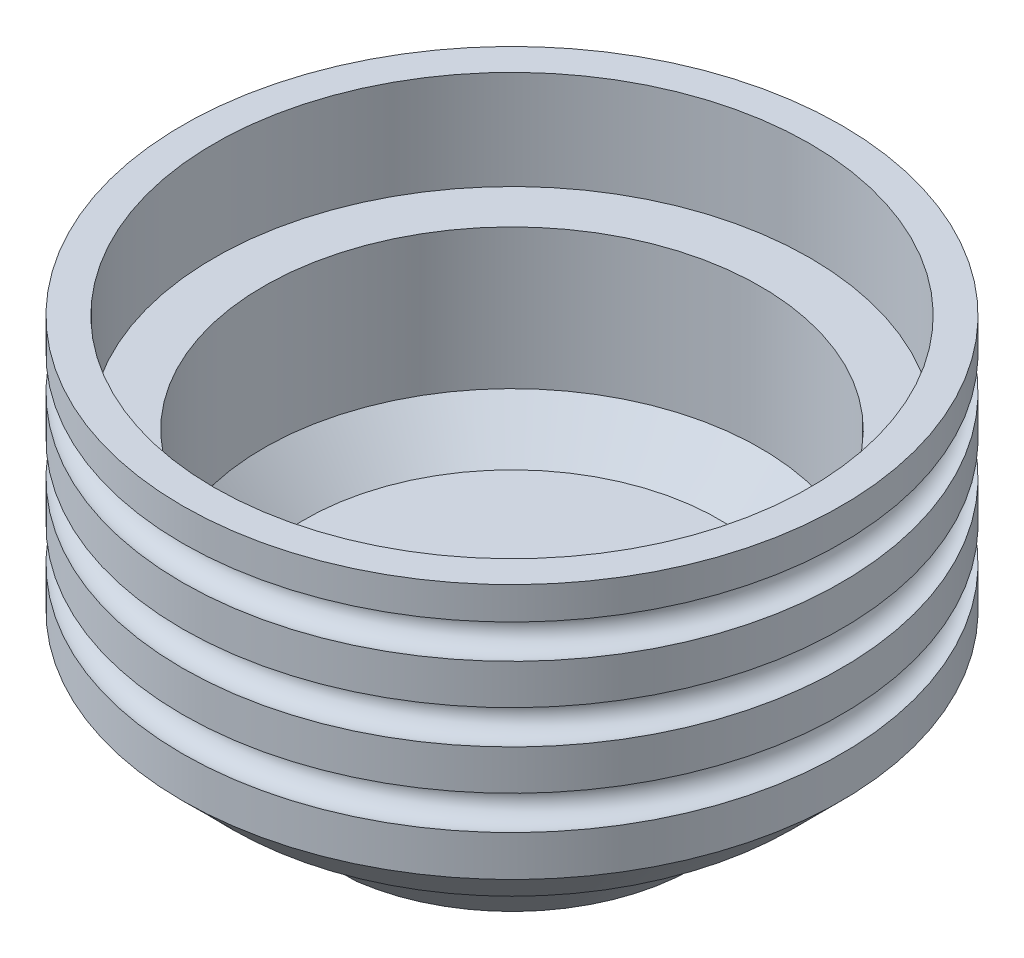
ISO-10303-21;
HEADER;
FILE_DESCRIPTION(('STEP AP214'),'2;1');
FILE_NAME('part.step','',(''),(''),'','','');
FILE_SCHEMA(('AUTOMOTIVE_DESIGN { 1 0 10303 214 1 1 1 1 }'));
ENDSEC;
DATA;
#1=APPLICATION_CONTEXT('core data for automotive mechanical design processes');
#2=APPLICATION_PROTOCOL_DEFINITION('international standard','automotive_design',2000,#1);
#3=PRODUCT_CONTEXT('',#1,'mechanical');
#4=PRODUCT('Part','Part','',(#3));
#5=PRODUCT_RELATED_PRODUCT_CATEGORY('part','',(#4));
#6=PRODUCT_DEFINITION_FORMATION('','',#4);
#7=PRODUCT_DEFINITION_CONTEXT('part definition',#1,'design');
#8=PRODUCT_DEFINITION('design','',#6,#7);
#9=PRODUCT_DEFINITION_SHAPE('','',#8);
#10=(LENGTH_UNIT() NAMED_UNIT(*) SI_UNIT(.MILLI.,.METRE.));
#11=(NAMED_UNIT(*) PLANE_ANGLE_UNIT() SI_UNIT($,.RADIAN.));
#12=(NAMED_UNIT(*) SI_UNIT($,.STERADIAN.) SOLID_ANGLE_UNIT());
#13=UNCERTAINTY_MEASURE_WITH_UNIT(LENGTH_MEASURE(1.E-05),#10,'distance_accuracy_value','');
#14=(GEOMETRIC_REPRESENTATION_CONTEXT(3) GLOBAL_UNCERTAINTY_ASSIGNED_CONTEXT((#13)) GLOBAL_UNIT_ASSIGNED_CONTEXT((#10,
#11,#12)) REPRESENTATION_CONTEXT('',''));
#15=CARTESIAN_POINT('',(0.,0.,0.));
#16=DIRECTION('',(0.,0.,1.));
#17=DIRECTION('',(1.,0.,0.));
#18=AXIS2_PLACEMENT_3D('',#15,#16,#17);
#19=CARTESIAN_POINT('',(0.,-19.,0.));
#20=DIRECTION('',(0.,1.,0.));
#21=DIRECTION('',(0.,0.,1.));
#22=AXIS2_PLACEMENT_3D('',#19,#20,#21);
#23=PLANE('',#22);
#24=CARTESIAN_POINT('',(0.,-19.,-4.));
#25=DIRECTION('',(0.,1.,0.));
#26=DIRECTION('',(0.,0.,1.));
#27=AXIS2_PLACEMENT_3D('',#24,#25,#26);
#28=CIRCLE('',#27,5.125);
#29=CARTESIAN_POINT('',(3.075,-19.,0.0999999999999977));
#30=VERTEX_POINT('',#29);
#31=CARTESIAN_POINT('',(-3.075,-19.,0.0999999999999977));
#32=VERTEX_POINT('',#31);
#33=EDGE_CURVE('E206',#30,#32,#28,.T.);
#34=ORIENTED_EDGE('',*,*,#33,.T.);
#35=DIRECTION('',(1.,0.,0.));
#36=VECTOR('',#35,1.);
#37=CARTESIAN_POINT('',(0.,-19.,0.0999999999999977));
#38=LINE('',#37,#36);
#39=EDGE_CURVE('E166',#32,#30,#38,.T.);
#40=ORIENTED_EDGE('',*,*,#39,.T.);
#41=EDGE_LOOP('',(#34,#40));
#42=FACE_BOUND('',#41,.T.);
#43=DIRECTION('',(0.,0.,-1.));
#44=VECTOR('',#43,1.);
#45=CARTESIAN_POINT('',(-3.,-19.,0.));
#46=LINE('',#45,#44);
#47=CARTESIAN_POINT('',(-3.,-19.,-24.9));
#48=VERTEX_POINT('',#47);
#49=CARTESIAN_POINT('',(-3.,-19.,-25.9206666185133));
#50=VERTEX_POINT('',#49);
#51=EDGE_CURVE('E147',#48,#50,#46,.T.);
#52=ORIENTED_EDGE('',*,*,#51,.F.);
#53=DIRECTION('',(-1.,0.,0.));
#54=VECTOR('',#53,1.);
#55=CARTESIAN_POINT('',(0.,-19.,-24.9));
#56=LINE('',#55,#54);
#57=CARTESIAN_POINT('',(3.,-19.,-24.9));
#58=VERTEX_POINT('',#57);
#59=EDGE_CURVE('E125',#58,#48,#56,.T.);
#60=ORIENTED_EDGE('',*,*,#59,.F.);
#61=DIRECTION('',(0.,0.,1.));
#62=VECTOR('',#61,1.);
#63=CARTESIAN_POINT('',(3.,-19.,0.));
#64=LINE('',#63,#62);
#65=CARTESIAN_POINT('',(3.,-19.,-25.9206666185133));
#66=VERTEX_POINT('',#65);
#67=EDGE_CURVE('E137',#66,#58,#64,.T.);
#68=ORIENTED_EDGE('',*,*,#67,.F.);
#69=CARTESIAN_POINT('',(0.,-19.,-4.));
#70=DIRECTION('',(0.,1.,0.));
#71=DIRECTION('',(0.,0.,1.));
#72=AXIS2_PLACEMENT_3D('',#69,#70,#71);
#73=CIRCLE('',#72,22.1250000000001);
#74=CARTESIAN_POINT('',(3.,-19.,17.9206666185133));
#75=VERTEX_POINT('',#74);
#76=EDGE_CURVE('E224',#66,#75,#73,.F.);
#77=ORIENTED_EDGE('',*,*,#76,.T.);
#78=DIRECTION('',(0.,0.,-1.));
#79=VECTOR('',#78,1.);
#80=CARTESIAN_POINT('',(3.,-19.,0.));
#81=LINE('',#80,#79);
#82=CARTESIAN_POINT('',(3.,-19.,16.1));
#83=VERTEX_POINT('',#82);
#84=EDGE_CURVE('E158',#75,#83,#81,.T.);
#85=ORIENTED_EDGE('',*,*,#84,.T.);
#86=DIRECTION('',(-1.,0.,0.));
#87=VECTOR('',#86,1.);
#88=CARTESIAN_POINT('',(0.,-19.,16.1));
#89=LINE('',#88,#87);
#90=CARTESIAN_POINT('',(-3.,-19.,16.1));
#91=VERTEX_POINT('',#90);
#92=EDGE_CURVE('E344',#83,#91,#89,.T.);
#93=ORIENTED_EDGE('',*,*,#92,.T.);
#94=DIRECTION('',(0.,0.,1.));
#95=VECTOR('',#94,1.);
#96=CARTESIAN_POINT('',(-3.,-19.,0.));
#97=LINE('',#96,#95);
#98=CARTESIAN_POINT('',(-3.,-19.,17.9206666185133));
#99=VERTEX_POINT('',#98);
#100=EDGE_CURVE('E163',#91,#99,#97,.T.);
#101=ORIENTED_EDGE('',*,*,#100,.T.);
#102=EDGE_CURVE('E225',#99,#50,#73,.F.);
#103=ORIENTED_EDGE('',*,*,#102,.T.);
#104=EDGE_LOOP('',(#52,#60,#68,#77,#85,#93,#101,#103));
#105=FACE_BOUND('',#104,.T.);
#106=ADVANCED_FACE('F40',(#42,#105),#23,.F.);
#107=CARTESIAN_POINT('',(0.,-9.00000000000001,-4.));
#108=DIRECTION('',(0.,1.,0.));
#109=DIRECTION('',(0.,0.,1.));
#110=AXIS2_PLACEMENT_3D('',#107,#108,#109);
#111=CONICAL_SURFACE('',#110,32.1250000000002,0.785398163397454);
#112=CARTESIAN_POINT('',(0.,-9.00000000000001,-4.));
#113=DIRECTION('',(0.,-1.,0.));
#114=DIRECTION('',(0.,0.,-1.));
#115=AXIS2_PLACEMENT_3D('',#112,#113,#114);
#116=CIRCLE('',#115,32.1250000000002);
#117=CARTESIAN_POINT('',(0.,-9.,-36.1250000000002));
#118=VERTEX_POINT('',#117);
#119=EDGE_CURVE('E221',#118,#118,#116,.F.);
#120=ORIENTED_EDGE('',*,*,#119,.F.);
#121=EDGE_LOOP('',(#120));
#122=FACE_BOUND('',#121,.T.);
#123=CARTESIAN_POINT('',(-3.,-31.2883984071456,-13.3679630067878));
#124=CARTESIAN_POINT('',(-3.,-30.9571847002128,-13.7156921580461));
#125=CARTESIAN_POINT('',(-3.,-30.6251283592073,-14.0626157323693));
#126=CARTESIAN_POINT('',(-3.,-29.9596807881349,-14.7551770104405));
#127=CARTESIAN_POINT('',(-3.,-29.6262895654317,-15.1008147212616));
#128=CARTESIAN_POINT('',(-3.,-28.9585239138428,-15.7911282513961));
#129=CARTESIAN_POINT('',(-3.,-28.6241494996384,-16.1358040849244));
#130=CARTESIAN_POINT('',(-3.,-27.9546240810409,-16.8244015607096));
#131=CARTESIAN_POINT('',(-3.,-27.6194730754091,-17.1683232017617));
#132=CARTESIAN_POINT('',(-3.,-26.6131233601295,-18.1991865889103));
#133=CARTESIAN_POINT('',(-3.,-25.9410150002997,-18.8852401603259));
#134=CARTESIAN_POINT('',(-3.,-24.5952067675185,-20.2557895234258));
#135=CARTESIAN_POINT('',(-3.,-23.921506886924,-20.9402853075978));
#136=CARTESIAN_POINT('',(-3.,-22.3535043407578,-22.5308475848738));
#137=CARTESIAN_POINT('',(-3.,-21.458784230633,-23.4365024725553));
#138=CARTESIAN_POINT('',(-3.,-19.6680835280415,-25.2465653239826));
#139=CARTESIAN_POINT('',(-3.,-18.7721029350481,-26.150973287207));
#140=CARTESIAN_POINT('',(-3.,-16.979268704656,-27.9589219568187));
#141=CARTESIAN_POINT('',(-3.,-16.0824150679328,-28.862462663876));
#142=CARTESIAN_POINT('',(-3.,-14.2880779452446,-30.6689185052311));
#143=CARTESIAN_POINT('',(-3.,-13.390594459222,-31.5718336394718));
#144=CARTESIAN_POINT('',(-3.,-10.6973824472921,-34.2799620759743));
#145=CARTESIAN_POINT('',(-3.,-8.90096250829623,-36.0844877385659));
#146=CARTESIAN_POINT('',(-3.,-6.20551917333774,-38.7904616327129));
#147=CARTESIAN_POINT('',(-3.,-5.30690348954272,-39.6923161625089));
#148=CARTESIAN_POINT('',(-3.,-3.50944850736083,-41.4958021289376));
#149=CARTESIAN_POINT('',(-3.,-2.61060920900261,-42.3974335655989));
#150=CARTESIAN_POINT('',(-3.,-1.71168208416514,-43.2989774566043));
#151=B_SPLINE_CURVE_WITH_KNOTS('',3,(#123,#124,#125,#126,#127,#128,#129,#130,#131,#132,#133,
#134,#135,#136,#137,#138,#139,#140,#141,#142,#143,#144,#145,#146,#147,#148,#149,#150),
.UNSPECIFIED.,.F.,.F.,(4,2,2,2,2,2,2,2,2,2,2,2,2,4),(0.,1.44067685381629,2.88134577128063,
4.32199328429975,5.7626430968317,8.64388689694456,11.5251445623137,15.3443849663914,
19.1636269669731,22.9828660148264,26.8021054111343,34.4408829177971,38.2602631834437,
42.0796429596989),.UNSPECIFIED.);
#152=CARTESIAN_POINT('',(-3.,-14.0000804913108,-30.9585099431122));
#153=VERTEX_POINT('',#152);
#154=EDGE_CURVE('E134',#50,#153,#151,.T.);
#155=ORIENTED_EDGE('',*,*,#154,.F.);
#156=ORIENTED_EDGE('',*,*,#102,.F.);
#157=CARTESIAN_POINT('',(-3.,-32.0232495696429,4.59312870242873));
#158=CARTESIAN_POINT('',(-3.,-31.7181615775267,4.91621524831907));
#159=CARTESIAN_POINT('',(-3.,-31.4121483833083,5.23842430907756));
#160=CARTESIAN_POINT('',(-3.,-30.7986581689354,5.88144164330902));
#161=CARTESIAN_POINT('',(-3.,-30.4911811600731,6.20224992755151));
#162=CARTESIAN_POINT('',(-3.,-29.8751516790356,6.84281810304724));
#163=CARTESIAN_POINT('',(-3.,-29.5665992296772,7.16257801626696));
#164=CARTESIAN_POINT('',(-3.,-28.9486448141337,7.80127706732667));
#165=CARTESIAN_POINT('',(-3.,-28.639242846054,8.12021620333311));
#166=CARTESIAN_POINT('',(-3.,-27.7100593078777,9.07605091447187));
#167=CARTESIAN_POINT('',(-3.,-27.0892841179938,9.71198037450225));
#168=CARTESIAN_POINT('',(-3.,-25.8459957676491,10.9821447278067));
#169=CARTESIAN_POINT('',(-3.,-25.2234825953044,11.6163796094354));
#170=CARTESIAN_POINT('',(-3.,-23.6210104536009,13.2459458262905));
#171=CARTESIAN_POINT('',(-3.,-22.6401721195672,14.2404122074095));
#172=CARTESIAN_POINT('',(-3.,-20.6767175692679,16.2275885009957));
#173=CARTESIAN_POINT('',(-3.,-19.694101351422,17.2202984119002));
#174=CARTESIAN_POINT('',(-3.,-17.7276969213472,19.2045557825919));
#175=CARTESIAN_POINT('',(-3.,-16.7439087096106,20.1961032428672));
#176=CARTESIAN_POINT('',(-3.,-14.775525614848,22.1783971890029));
#177=CARTESIAN_POINT('',(-3.,-13.7909307317261,23.1691436747682));
#178=CARTESIAN_POINT('',(-3.,-11.821101209923,25.1501196884616));
#179=CARTESIAN_POINT('',(-3.,-10.835866536119,26.140349181461));
#180=CARTESIAN_POINT('',(-3.,-8.8649662052051,28.1203794101149));
#181=CARTESIAN_POINT('',(-3.,-7.87930054803494,29.1101801457093));
#182=CARTESIAN_POINT('',(-3.,-5.90764642236616,31.0894505740272));
#183=CARTESIAN_POINT('',(-3.,-4.92165795543774,32.0789202683151));
#184=CARTESIAN_POINT('',(-3.,-2.9494218420596,34.0576008969679));
#185=CARTESIAN_POINT('',(-3.,-1.9631741956665,35.0468118313893));
#186=CARTESIAN_POINT('',(-3.,-0.976830921667842,36.0359273695811));
#187=B_SPLINE_CURVE_WITH_KNOTS('',3,(#157,#158,#159,#160,#161,#162,#163,#164,#165,#166,#167,
#168,#169,#170,#171,#172,#173,#174,#175,#176,#177,#178,#179,#180,#181,#182,#183,#184,#185,#186),
.UNSPECIFIED.,.F.,.F.,(4,2,2,2,2,2,2,2,2,2,2,2,2,2,4),(0.,1.33310047811417,2.66619068888892,
3.99925278662486,5.33231785974101,7.99837890868154,10.6644582322202,14.8548076208719,
19.0451607357644,23.2355120908177,27.4258639435529,31.6164694856932,35.8070756152406,
39.9976616551168,44.1882467803368),.UNSPECIFIED.);
#188=CARTESIAN_POINT('',(-3.,-14.0000804913108,22.9585099431122));
#189=VERTEX_POINT('',#188);
#190=EDGE_CURVE('E239',#99,#189,#187,.T.);
#191=ORIENTED_EDGE('',*,*,#190,.T.);
#192=CARTESIAN_POINT('',(0.,-14.0000804913108,-4.));
#193=DIRECTION('',(0.,1.,0.));
#194=DIRECTION('',(0.,0.,1.));
#195=AXIS2_PLACEMENT_3D('',#192,#193,#194);
#196=CIRCLE('',#195,27.1249195086894);
#197=CARTESIAN_POINT('',(3.,-14.0000804913108,22.9585099431122));
#198=VERTEX_POINT('',#197);
#199=EDGE_CURVE('E228',#189,#198,#196,.T.);
#200=ORIENTED_EDGE('',*,*,#199,.T.);
#201=CARTESIAN_POINT('',(3.,-0.976830921667844,36.0359273695811));
#202=CARTESIAN_POINT('',(3.,-2.27689023956105,34.732198638874));
#203=CARTESIAN_POINT('',(3.,-3.57679499027358,33.4283156270582));
#204=CARTESIAN_POINT('',(3.,-6.17611074025169,30.82006620614));
#205=CARTESIAN_POINT('',(3.,-7.47552174114422,29.515699798659));
#206=CARTESIAN_POINT('',(3.,-10.0736522377888,26.9063219626293));
#207=CARTESIAN_POINT('',(3.,-11.3723717447703,25.6013105452627));
#208=CARTESIAN_POINT('',(3.,-13.9688324738826,22.9903057710291));
#209=CARTESIAN_POINT('',(3.,-15.2665736926899,21.6843124108559));
#210=CARTESIAN_POINT('',(3.,-17.2120480066494,19.7241552398725));
#211=CARTESIAN_POINT('',(3.,-17.8603593650374,19.070565393936));
#212=CARTESIAN_POINT('',(3.,-19.1564811933819,17.7628898941352));
#213=CARTESIAN_POINT('',(3.,-19.8042916636197,17.10880424055));
#214=CARTESIAN_POINT('',(3.,-21.0992519067023,15.7999901615198));
#215=CARTESIAN_POINT('',(3.,-21.7464016851305,15.1452617415999));
#216=CARTESIAN_POINT('',(3.,-23.0398196886008,13.8349317267779));
#217=CARTESIAN_POINT('',(3.,-23.6860879117997,13.1793301300557));
#218=CARTESIAN_POINT('',(3.,-24.9774121517597,11.866894737262));
#219=CARTESIAN_POINT('',(3.,-25.6224681311512,11.2100609044126));
#220=CARTESIAN_POINT('',(3.,-26.9107970035024,9.89465230618097));
#221=CARTESIAN_POINT('',(3.,-27.5540699066914,9.23607755082869));
#222=CARTESIAN_POINT('',(3.,-28.5169253907263,8.24619670823175));
#223=CARTESIAN_POINT('',(3.,-28.8375399949232,7.91589470114628));
#224=CARTESIAN_POINT('',(3.,-29.4778812949687,7.25443240122578));
#225=CARTESIAN_POINT('',(3.,-29.7976079929087,6.92327211041583));
#226=CARTESIAN_POINT('',(3.,-30.4359296897338,6.2598488347081));
#227=CARTESIAN_POINT('',(3.,-30.7545246662437,5.92758582825694));
#228=CARTESIAN_POINT('',(3.,-31.3901592752795,5.26157084451692));
#229=CARTESIAN_POINT('',(3.,-31.7071988950944,4.92781885510191));
#230=CARTESIAN_POINT('',(3.,-32.0232495696429,4.59312870242875));
#231=B_SPLINE_CURVE_WITH_KNOTS('',3,(#201,#202,#203,#204,#205,#206,#207,#208,#209,#210,#211,
#212,#213,#214,#215,#216,#217,#218,#219,#220,#221,#222,#223,#224,#225,#226,#227,#228,#229,#230),
.UNSPECIFIED.,.F.,.F.,(4,2,2,2,2,2,2,2,2,2,2,2,2,2,4),(0.,5.52347419525201,11.0469300297394,
16.5702932501609,22.09367515142,24.8554471654088,27.6172176265865,30.3789645522743,
33.1407172432266,35.9025537173417,38.6643743141079,40.0453285840018,41.4262795985574,
42.8072577656563,44.1882471999239),.UNSPECIFIED.);
#232=EDGE_CURVE('E231',#198,#75,#231,.T.);
#233=ORIENTED_EDGE('',*,*,#232,.T.);
#234=ORIENTED_EDGE('',*,*,#76,.F.);
#235=CARTESIAN_POINT('',(3.,-1.71168208416514,-43.2989774566043));
#236=CARTESIAN_POINT('',(3.,-2.94964353312506,-42.0573923011552));
#237=CARTESIAN_POINT('',(3.,-4.1874551417678,-40.815657607785));
#238=CARTESIAN_POINT('',(3.,-6.6626111111398,-38.3317284235228));
#239=CARTESIAN_POINT('',(3.,-7.89995547295336,-37.0895339337113));
#240=CARTESIAN_POINT('',(3.,-10.3739985792917,-34.6045352965688));
#241=CARTESIAN_POINT('',(3.,-11.6106973322499,-33.3617311576348));
#242=CARTESIAN_POINT('',(3.,-14.0831880300543,-30.875214909128));
#243=CARTESIAN_POINT('',(3.,-15.318979972692,-29.6315027973585));
#244=CARTESIAN_POINT('',(3.,-17.171632721341,-27.7648793655712));
#245=CARTESIAN_POINT('',(3.,-17.7890180512612,-27.1424886682806));
#246=CARTESIAN_POINT('',(3.,-19.0233404844451,-25.8972633496616));
#247=CARTESIAN_POINT('',(3.,-19.6402775878673,-25.2744287284904));
#248=CARTESIAN_POINT('',(3.,-20.873570096739,-24.02819116622));
#249=CARTESIAN_POINT('',(3.,-21.4899255056648,-23.4047882285615));
#250=CARTESIAN_POINT('',(3.,-22.721871702521,-22.1572254505722));
#251=CARTESIAN_POINT('',(3.,-23.3374624894348,-21.5330656092371));
#252=CARTESIAN_POINT('',(3.,-24.5676128645026,-20.2837031445064));
#253=CARTESIAN_POINT('',(3.,-25.1821724295518,-19.658500498356));
#254=CARTESIAN_POINT('',(3.,-26.4098186286521,-18.4066539546145));
#255=CARTESIAN_POINT('',(3.,-27.0229052680878,-17.7800100623087));
#256=CARTESIAN_POINT('',(3.,-27.9408973403711,-16.8384337452955));
#257=CARTESIAN_POINT('',(3.,-28.2466250530123,-16.5243031137879));
#258=CARTESIAN_POINT('',(3.,-28.8573902765443,-15.8953722535539));
#259=CARTESIAN_POINT('',(3.,-29.162427788368,-15.5805720257338));
#260=CARTESIAN_POINT('',(3.,-29.7716419920526,-14.9501315165157));
#261=CARTESIAN_POINT('',(3.,-30.0758186731944,-14.6344912247514));
#262=CARTESIAN_POINT('',(3.,-30.6830325697609,-14.0021139926191));
#263=CARTESIAN_POINT('',(3.,-30.9860697798543,-13.6853770471334));
#264=CARTESIAN_POINT('',(3.,-31.2883984071456,-13.3679630067878));
#265=B_SPLINE_CURVE_WITH_KNOTS('',3,(#235,#236,#237,#238,#239,#240,#241,#242,#243,#244,#245,
#246,#247,#248,#249,#250,#251,#252,#253,#254,#255,#256,#257,#258,#259,#260,#261,#262,#263,#264),
.UNSPECIFIED.,.F.,.F.,(4,2,2,2,2,2,2,2,2,2,2,2,2,2,4),(0.,5.25991840845978,10.519824534749,
15.7796601407199,21.0395085151574,23.6694918904005,26.2994743347235,28.9294409609834,
31.5594110806291,34.1894393592535,36.8194580084466,38.1344961120592,39.4495324370784,
40.7645850654845,42.0796438389727),.UNSPECIFIED.);
#266=CARTESIAN_POINT('',(3.,-14.0000804913108,-30.9585099431122));
#267=VERTEX_POINT('',#266);
#268=EDGE_CURVE('E337',#267,#66,#265,.T.);
#269=ORIENTED_EDGE('',*,*,#268,.F.);
#270=CARTESIAN_POINT('',(0.,-14.0000804913108,-4.));
#271=DIRECTION('',(0.,-1.,0.));
#272=DIRECTION('',(0.,0.,-1.));
#273=AXIS2_PLACEMENT_3D('',#270,#271,#272);
#274=CIRCLE('',#273,27.1249195086894);
#275=EDGE_CURVE('E343',#153,#267,#274,.T.);
#276=ORIENTED_EDGE('',*,*,#275,.F.);
#277=EDGE_LOOP('',(#155,#156,#191,#200,#233,#234,#269,#276));
#278=FACE_BOUND('',#277,.T.);
#279=ADVANCED_FACE('F247',(#122,#278),#111,.T.);
#280=CARTESIAN_POINT('',(0.,-2.,-4.));
#281=DIRECTION('',(0.,1.,0.));
#282=DIRECTION('',(0.,0.,1.));
#283=AXIS2_PLACEMENT_3D('',#280,#281,#282);
#284=CYLINDRICAL_SURFACE('',#283,40.);
#285=CARTESIAN_POINT('',(0.,6.06533895523229,-4.));
#286=DIRECTION('',(0.,1.,0.));
#287=DIRECTION('',(0.,0.,1.));
#288=AXIS2_PLACEMENT_3D('',#285,#286,#287);
#289=CIRCLE('',#288,40.);
#290=CARTESIAN_POINT('',(0.,6.06533895523229,36.));
#291=VERTEX_POINT('',#290);
#292=EDGE_CURVE('E212',#291,#291,#289,.T.);
#293=ORIENTED_EDGE('',*,*,#292,.T.);
#294=EDGE_LOOP('',(#293));
#295=FACE_BOUND('',#294,.T.);
#296=CARTESIAN_POINT('',(0.,10.9346610447677,-4.));
#297=DIRECTION('',(0.,1.,0.));
#298=DIRECTION('',(0.,0.,1.));
#299=AXIS2_PLACEMENT_3D('',#296,#297,#298);
#300=CIRCLE('',#299,40.);
#301=CARTESIAN_POINT('',(0.,10.9346610447677,36.));
#302=VERTEX_POINT('',#301);
#303=EDGE_CURVE('E177',#302,#302,#300,.T.);
#304=ORIENTED_EDGE('',*,*,#303,.F.);
#305=EDGE_LOOP('',(#304));
#306=FACE_BOUND('',#305,.T.);
#307=ADVANCED_FACE('F283',(#295,#306),#284,.T.);
#308=CARTESIAN_POINT('',(0.,4.,-4.));
#309=DIRECTION('',(0.,1.,0.));
#310=DIRECTION('',(0.,0.,1.));
#311=AXIS2_PLACEMENT_3D('',#308,#309,#310);
#312=TOROIDAL_SURFACE('',#311,39.5,2.125);
#313=CARTESIAN_POINT('',(0.,1.93466104476771,-4.));
#314=DIRECTION('',(0.,1.,0.));
#315=DIRECTION('',(0.,0.,1.));
#316=AXIS2_PLACEMENT_3D('',#313,#314,#315);
#317=CIRCLE('',#316,40.);
#318=CARTESIAN_POINT('',(0.,1.9346610447677,36.));
#319=VERTEX_POINT('',#318);
#320=EDGE_CURVE('E209',#319,#319,#317,.T.);
#321=ORIENTED_EDGE('',*,*,#320,.T.);
#322=EDGE_LOOP('',(#321));
#323=FACE_BOUND('',#322,.T.);
#324=ORIENTED_EDGE('',*,*,#292,.F.);
#325=EDGE_LOOP('',(#324));
#326=FACE_BOUND('',#325,.T.);
#327=ADVANCED_FACE('F409',(#323,#326),#312,.F.);
#328=CARTESIAN_POINT('',(0.,-3.00000000000001,-4.));
#329=DIRECTION('',(0.,-1.,0.));
#330=DIRECTION('',(0.,0.,-1.));
#331=AXIS2_PLACEMENT_3D('',#328,#329,#330);
#332=CIRCLE('',#331,40.);
#333=CARTESIAN_POINT('',(0.,-3.00000000000001,-44.));
#334=VERTEX_POINT('',#333);
#335=EDGE_CURVE('E49',#334,#334,#332,.F.);
#336=ORIENTED_EDGE('',*,*,#335,.T.);
#337=EDGE_LOOP('',(#336));
#338=FACE_BOUND('',#337,.T.);
#339=ORIENTED_EDGE('',*,*,#320,.F.);
#340=EDGE_LOOP('',(#339));
#341=FACE_BOUND('',#340,.T.);
#342=ADVANCED_FACE('F394',(#338,#341),#284,.T.);
#343=CARTESIAN_POINT('',(0.,-9.00000000000001,0.));
#344=DIRECTION('',(0.,-1.,0.));
#345=DIRECTION('',(0.,0.,-1.));
#346=AXIS2_PLACEMENT_3D('',#343,#344,#345);
#347=PLANE('',#346);
#348=CARTESIAN_POINT('',(0.,-9.00000000000001,-4.));
#349=DIRECTION('',(0.,-1.,0.));
#350=DIRECTION('',(0.,0.,-1.));
#351=AXIS2_PLACEMENT_3D('',#348,#349,#350);
#352=CIRCLE('',#351,34.);
#353=CARTESIAN_POINT('',(0.,-9.,-38.));
#354=VERTEX_POINT('',#353);
#355=EDGE_CURVE('E12',#354,#354,#352,.T.);
#356=ORIENTED_EDGE('',*,*,#355,.T.);
#357=EDGE_LOOP('',(#356));
#358=FACE_BOUND('',#357,.T.);
#359=ORIENTED_EDGE('',*,*,#119,.T.);
#360=EDGE_LOOP('',(#359));
#361=FACE_BOUND('',#360,.T.);
#362=ADVANCED_FACE('F312',(#358,#361),#347,.T.);
#363=CARTESIAN_POINT('',(0.,-2.,-4.));
#364=DIRECTION('',(0.,1.,0.));
#365=DIRECTION('',(0.,0.,1.));
#366=AXIS2_PLACEMENT_3D('',#363,#364,#365);
#367=CYLINDRICAL_SURFACE('',#366,5.12499999999999);
#368=CARTESIAN_POINT('',(1.65,-17.0000804913108,-8.85212582277087));
#369=CARTESIAN_POINT('',(1.64999983049932,-16.9100162160121,-8.85212602928842));
#370=CARTESIAN_POINT('',(1.64260084886905,-16.8199496326794,-8.85466088321865));
#371=CARTESIAN_POINT('',(1.6132917939833,-16.6424724729104,-8.86447812677328));
#372=CARTESIAN_POINT('',(1.59137849798871,-16.5550624908516,-8.87176157076268));
#373=CARTESIAN_POINT('',(1.53388039924043,-16.3854962825735,-8.89016738101737));
#374=CARTESIAN_POINT('',(1.4983209401767,-16.303330644526,-8.90128262698166));
#375=CARTESIAN_POINT('',(1.41462539935678,-16.1461067570813,-8.92608953559805));
#376=CARTESIAN_POINT('',(1.36648684239488,-16.071049910455,-8.93978170516629));
#377=CARTESIAN_POINT('',(1.25711888495623,-15.9274363781356,-8.96875985617042));
#378=CARTESIAN_POINT('',(1.19550898211507,-15.8591770073063,-8.98408358709558));
#379=CARTESIAN_POINT('',(1.06176045553053,-15.7337584590155,-9.01427801289509));
#380=CARTESIAN_POINT('',(0.989620268548545,-15.676600932583,-9.02914864010856));
#381=CARTESIAN_POINT('',(0.834705633882425,-15.5736800989301,-9.05719549672786));
#382=CARTESIAN_POINT('',(0.751716411566314,-15.5282253590672,-9.07032212307545));
#383=CARTESIAN_POINT('',(0.578775675174062,-15.4520364844895,-9.09295937533634));
#384=CARTESIAN_POINT('',(0.488825910590631,-15.4212986646307,-9.10247090635311));
#385=CARTESIAN_POINT('',(0.307632385652744,-15.3764157887833,-9.11653899572064));
#386=CARTESIAN_POINT('',(0.216526612611126,-15.3617620518389,-9.12124710362544));
#387=CARTESIAN_POINT('',(0.0330359420991678,-15.3478490476392,-9.12571432575045));
#388=CARTESIAN_POINT('',(-0.0593486419137782,-15.3485860723669,-9.12547463201917));
#389=CARTESIAN_POINT('',(-0.239185254371301,-15.3651043818021,-9.12017752267657));
#390=CARTESIAN_POINT('',(-0.326694023397648,-15.380333760455,-9.11529685247835));
#391=CARTESIAN_POINT('',(-0.497840163647901,-15.4244957253302,-9.10148558505181));
#392=CARTESIAN_POINT('',(-0.581477277140357,-15.4534292223833,-9.09255471863285));
#393=CARTESIAN_POINT('',(-0.743749501835258,-15.5245181212971,-9.0714147425167));
#394=CARTESIAN_POINT('',(-0.822307857654039,-15.5668363190727,-9.05916555092322));
#395=CARTESIAN_POINT('',(-0.971376205816892,-15.6633612192278,-9.03267261096371));
#396=CARTESIAN_POINT('',(-1.04188406211286,-15.7175710657377,-9.01842833546186));
#397=CARTESIAN_POINT('',(-1.17613772548699,-15.8391508466641,-8.988713542197));
#398=CARTESIAN_POINT('',(-1.23944822328006,-15.9069956992476,-8.97321664950998));
#399=CARTESIAN_POINT('',(-1.35392782485948,-16.0524789593197,-8.94327974163394));
#400=CARTESIAN_POINT('',(-1.40509530956786,-16.1301186706858,-8.92883986755888));
#401=CARTESIAN_POINT('',(-1.49438517364342,-16.2942840245871,-8.90251372670318));
#402=CARTESIAN_POINT('',(-1.53233637776412,-16.3809086665386,-8.89066165995097));
#403=CARTESIAN_POINT('',(-1.59297146774133,-16.5597944939294,-8.87125162047892));
#404=CARTESIAN_POINT('',(-1.6156612420187,-16.6520534904227,-8.86369199175427));
#405=CARTESIAN_POINT('',(-1.6442689239939,-16.835397673135,-8.85409353827029));
#406=CARTESIAN_POINT('',(-1.65085717843499,-16.9263667647321,-8.85183421841321));
#407=CARTESIAN_POINT('',(-1.64896429002488,-17.1081202616428,-8.85247813619806));
#408=CARTESIAN_POINT('',(-1.6404856537904,-17.1989046951617,-8.85538051510942));
#409=CARTESIAN_POINT('',(-1.60930025053497,-17.3747537281604,-8.86580215079394));
#410=CARTESIAN_POINT('',(-1.58704706541697,-17.4599084176804,-8.87317407700031));
#411=CARTESIAN_POINT('',(-1.52948200992128,-17.6252624836598,-8.89154540336148));
#412=CARTESIAN_POINT('',(-1.49416792507597,-17.7054610171132,-8.90254541862234));
#413=CARTESIAN_POINT('',(-1.41027408634907,-17.8612961265691,-8.92734358581304));
#414=CARTESIAN_POINT('',(-1.36132743765666,-17.936723069827,-8.94121591750569));
#415=CARTESIAN_POINT('',(-1.25198056363882,-18.0785362460366,-8.9700464283148));
#416=CARTESIAN_POINT('',(-1.19157718249031,-18.1449199793066,-8.98500490591409));
#417=CARTESIAN_POINT('',(-1.05784428224043,-18.2698048548184,-9.01512565015637));
#418=CARTESIAN_POINT('',(-0.984059988272022,-18.3278252691998,-9.03026748672438));
#419=CARTESIAN_POINT('',(-0.82743309070238,-18.4306853694762,-9.05838915459137));
#420=CARTESIAN_POINT('',(-0.744590865748952,-18.475525606052,-9.07136907620748));
#421=CARTESIAN_POINT('',(-0.572671043251403,-18.5503289423053,-9.09363567347041));
#422=CARTESIAN_POINT('',(-0.483642025141414,-18.5803956632171,-9.10294797942228));
#423=CARTESIAN_POINT('',(-0.301435604710491,-18.6250193061648,-9.11694209462154));
#424=CARTESIAN_POINT('',(-0.208259599627755,-18.6395814115471,-9.12162545133492));
#425=CARTESIAN_POINT('',(-0.0248164420782275,-18.6523408657197,-9.12572504021065));
#426=CARTESIAN_POINT('',(0.0653981180056883,-18.6512306218564,-9.12536413600201));
#427=CARTESIAN_POINT('',(0.24429624382559,-18.634366313943,-9.11995623002809));
#428=CARTESIAN_POINT('',(0.332979919539162,-18.618613306315,-9.11490956632329));
#429=CARTESIAN_POINT('',(0.505073884575932,-18.5733602154026,-9.10077284119828));
#430=CARTESIAN_POINT('',(0.588540535984569,-18.5440552554887,-9.0917402516494));
#431=CARTESIAN_POINT('',(0.74940927644244,-18.4727081704045,-9.07056215986822));
#432=CARTESIAN_POINT('',(0.826810293962294,-18.4306638010991,-9.05841610923633));
#433=CARTESIAN_POINT('',(0.976328228035729,-18.3333171972515,-9.03173744481256));
#434=CARTESIAN_POINT('',(1.04816191081606,-18.2775991057753,-9.01713568395568));
#435=CARTESIAN_POINT('',(1.18168809671543,-18.1552083670374,-8.9873767454206));
#436=CARTESIAN_POINT('',(1.24337746380322,-18.0885323449111,-8.97221939775161));
#437=CARTESIAN_POINT('',(1.35709919774836,-17.9432613500588,-8.94241755328903));
#438=CARTESIAN_POINT('',(1.40870695262712,-17.8643252209891,-8.92781082326864));
#439=CARTESIAN_POINT('',(1.49787626113833,-17.6984534455356,-8.90144520275025));
#440=CARTESIAN_POINT('',(1.53544262173759,-17.6115205495088,-8.88968533813571));
#441=CARTESIAN_POINT('',(1.59323260307512,-17.4381316907427,-8.87114942240703));
#442=CARTESIAN_POINT('',(1.61445467213174,-17.3520386835132,-8.86409082842599));
#443=CARTESIAN_POINT('',(1.64283643353991,-17.1773242035454,-8.85457958876868));
#444=CARTESIAN_POINT('',(1.65000016678815,-17.0887034648051,-8.85212561955824));
#445=CARTESIAN_POINT('',(1.65,-17.0000804913108,-8.85212582277087));
#446=B_SPLINE_CURVE_WITH_KNOTS('',3,(#368,#369,#370,#371,#372,#373,#374,#375,#376,#377,#378,
#379,#380,#381,#382,#383,#384,#385,#386,#387,#388,#389,#390,#391,#392,#393,#394,#395,#396,#397,
#398,#399,#400,#401,#402,#403,#404,#405,#406,#407,#408,#409,#410,#411,#412,#413,#414,#415,#416,
#417,#418,#419,#420,#421,#422,#423,#424,#425,#426,#427,#428,#429,#430,#431,#432,#433,#434,#435,
#436,#437,#438,#439,#440,#441,#442,#443,#444,#445),.UNSPECIFIED.,.T.,.F.,(4,2,2,2,2,2,2,2,2,2,2,
2,2,2,2,2,2,2,2,2,2,2,2,2,2,2,2,2,2,2,2,2,2,2,2,2,2,2,4),(0.,0.269865094985513,
0.539790130554647,0.809216267928944,1.07869546061439,1.35709268763894,1.63553128531617,
1.92069538304685,2.20578803776465,2.48157838991121,2.75730229807596,3.02292925359264,
3.2885738662226,3.5575824741119,3.82666229330204,4.10760808747497,4.3885913202885,
4.67308912889343,4.95747710471673,5.22980683176341,5.50209125667329,5.76585437873718,
6.02966224219495,6.30140108708498,6.57321489300144,6.85709475744246,7.1409627594151,
7.42281023588044,7.70456345833023,7.97390925926538,8.24323562939099,8.50879946546866,
8.77441010967602,9.04940314386414,9.32448103070252,9.60940334022482,9.89422801918216,
10.1598508146574,10.4253972489193),.UNSPECIFIED.);
#447=CARTESIAN_POINT('',(1.65,-17.0000804913108,-8.85212582277087));
#448=VERTEX_POINT('',#447);
#449=EDGE_CURVE('E128',#448,#448,#446,.T.);
#450=ORIENTED_EDGE('',*,*,#449,.F.);
#451=EDGE_LOOP('',(#450));
#452=FACE_BOUND('',#451,.T.);
#453=DIRECTION('',(0.,-1.,0.));
#454=VECTOR('',#453,1.);
#455=CARTESIAN_POINT('',(-3.075,-7.50000000000001,0.0999999999999992));
#456=LINE('',#455,#454);
#457=CARTESIAN_POINT('',(-3.075,-7.50000000000001,0.0999999999999992));
#458=VERTEX_POINT('',#457);
#459=EDGE_CURVE('E172',#458,#32,#456,.T.);
#460=ORIENTED_EDGE('',*,*,#459,.T.);
#461=ORIENTED_EDGE('',*,*,#33,.F.);
#462=DIRECTION('',(0.,-1.,0.));
#463=VECTOR('',#462,1.);
#464=CARTESIAN_POINT('',(3.075,-7.50000000000001,0.0999999999999992));
#465=LINE('',#464,#463);
#466=CARTESIAN_POINT('',(3.075,-7.50000000000001,0.0999999999999992));
#467=VERTEX_POINT('',#466);
#468=EDGE_CURVE('E174',#467,#30,#465,.T.);
#469=ORIENTED_EDGE('',*,*,#468,.F.);
#470=CARTESIAN_POINT('',(0.,-7.50000000000001,-4.));
#471=DIRECTION('',(0.,-1.,0.));
#472=DIRECTION('',(0.,0.,-1.));
#473=AXIS2_PLACEMENT_3D('',#470,#471,#472);
#474=CIRCLE('',#473,5.125);
#475=EDGE_CURVE('E167',#458,#467,#474,.F.);
#476=ORIENTED_EDGE('',*,*,#475,.F.);
#477=EDGE_LOOP('',(#460,#461,#469,#476));
#478=FACE_BOUND('',#477,.T.);
#479=CARTESIAN_POINT('',(0.,-6.,-4.));
#480=DIRECTION('',(0.,1.,0.));
#481=DIRECTION('',(0.,0.,1.));
#482=AXIS2_PLACEMENT_3D('',#479,#480,#481);
#483=CIRCLE('',#482,5.12499999999999);
#484=CARTESIAN_POINT('',(0.,-6.,1.125));
#485=VERTEX_POINT('',#484);
#486=EDGE_CURVE('E203',#485,#485,#483,.T.);
#487=ORIENTED_EDGE('',*,*,#486,.T.);
#488=EDGE_LOOP('',(#487));
#489=FACE_BOUND('',#488,.T.);
#490=ADVANCED_FACE('F307',(#452,#478,#489),#367,.F.);
#491=CARTESIAN_POINT('',(0.,-6.,0.));
#492=DIRECTION('',(0.,1.,0.));
#493=DIRECTION('',(0.,0.,1.));
#494=AXIS2_PLACEMENT_3D('',#491,#492,#493);
#495=PLANE('',#494);
#496=CARTESIAN_POINT('',(0.,-6.,-4.));
#497=DIRECTION('',(0.,1.,0.));
#498=DIRECTION('',(0.,0.,1.));
#499=AXIS2_PLACEMENT_3D('',#496,#497,#498);
#500=CIRCLE('',#499,25.15);
#501=CARTESIAN_POINT('',(0.,-6.00000000000001,21.15));
#502=VERTEX_POINT('',#501);
#503=EDGE_CURVE('E215',#502,#502,#500,.T.);
#504=ORIENTED_EDGE('',*,*,#503,.T.);
#505=EDGE_LOOP('',(#504));
#506=FACE_BOUND('',#505,.T.);
#507=ORIENTED_EDGE('',*,*,#486,.F.);
#508=EDGE_LOOP('',(#507));
#509=FACE_BOUND('',#508,.T.);
#510=ADVANCED_FACE('F303',(#506,#509),#495,.T.);
#511=CARTESIAN_POINT('',(0.,-2.,-4.));
#512=DIRECTION('',(0.,1.,0.));
#513=DIRECTION('',(0.,0.,1.));
#514=AXIS2_PLACEMENT_3D('',#511,#512,#513);
#515=CYLINDRICAL_SURFACE('',#514,30.15);
#516=CARTESIAN_POINT('',(0.,-1.00000000000002,-4.));
#517=DIRECTION('',(0.,1.,0.));
#518=DIRECTION('',(0.,0.,1.));
#519=AXIS2_PLACEMENT_3D('',#516,#517,#518);
#520=CIRCLE('',#519,30.15);
#521=CARTESIAN_POINT('',(0.,-1.00000000000003,26.15));
#522=VERTEX_POINT('',#521);
#523=EDGE_CURVE('E218',#522,#522,#520,.F.);
#524=ORIENTED_EDGE('',*,*,#523,.T.);
#525=EDGE_LOOP('',(#524));
#526=FACE_BOUND('',#525,.T.);
#527=CARTESIAN_POINT('',(0.,16.,-3.99999999999999));
#528=DIRECTION('',(0.,1.,0.));
#529=DIRECTION('',(0.,0.,1.));
#530=AXIS2_PLACEMENT_3D('',#527,#528,#529);
#531=CIRCLE('',#530,30.15);
#532=CARTESIAN_POINT('',(0.,16.,26.15));
#533=VERTEX_POINT('',#532);
#534=EDGE_CURVE('E200',#533,#533,#531,.T.);
#535=ORIENTED_EDGE('',*,*,#534,.T.);
#536=EDGE_LOOP('',(#535));
#537=FACE_BOUND('',#536,.T.);
#538=ADVANCED_FACE('F299',(#526,#537),#515,.F.);
#539=CARTESIAN_POINT('',(0.,16.,0.));
#540=DIRECTION('',(0.,1.,0.));
#541=DIRECTION('',(0.,0.,1.));
#542=AXIS2_PLACEMENT_3D('',#539,#540,#541);
#543=PLANE('',#542);
#544=CARTESIAN_POINT('',(0.,16.,-3.99999999999999));
#545=DIRECTION('',(0.,1.,0.));
#546=DIRECTION('',(0.,0.,1.));
#547=AXIS2_PLACEMENT_3D('',#544,#545,#546);
#548=CIRCLE('',#547,36.15);
#549=CARTESIAN_POINT('',(0.,16.,32.15));
#550=VERTEX_POINT('',#549);
#551=EDGE_CURVE('E197',#550,#550,#548,.T.);
#552=ORIENTED_EDGE('',*,*,#551,.T.);
#553=EDGE_LOOP('',(#552));
#554=FACE_BOUND('',#553,.T.);
#555=ORIENTED_EDGE('',*,*,#534,.F.);
#556=EDGE_LOOP('',(#555));
#557=FACE_BOUND('',#556,.T.);
#558=ADVANCED_FACE('F295',(#554,#557),#543,.T.);
#559=CARTESIAN_POINT('',(0.,-2.,-4.));
#560=DIRECTION('',(0.,1.,0.));
#561=DIRECTION('',(0.,0.,1.));
#562=AXIS2_PLACEMENT_3D('',#559,#560,#561);
#563=CYLINDRICAL_SURFACE('',#562,36.15);
#564=CARTESIAN_POINT('',(0.,28.,-3.99999999999999));
#565=DIRECTION('',(0.,1.,0.));
#566=DIRECTION('',(0.,0.,1.));
#567=AXIS2_PLACEMENT_3D('',#564,#565,#566);
#568=CIRCLE('',#567,36.15);
#569=CARTESIAN_POINT('',(0.,28.,32.15));
#570=VERTEX_POINT('',#569);
#571=EDGE_CURVE('E194',#570,#570,#568,.T.);
#572=ORIENTED_EDGE('',*,*,#571,.T.);
#573=EDGE_LOOP('',(#572));
#574=FACE_BOUND('',#573,.T.);
#575=ORIENTED_EDGE('',*,*,#551,.F.);
#576=EDGE_LOOP('',(#575));
#577=FACE_BOUND('',#576,.T.);
#578=ADVANCED_FACE('F291',(#574,#577),#563,.F.);
#579=CARTESIAN_POINT('',(0.,28.,0.));
#580=DIRECTION('',(0.,1.,0.));
#581=DIRECTION('',(0.,0.,1.));
#582=AXIS2_PLACEMENT_3D('',#579,#580,#581);
#583=PLANE('',#582);
#584=CARTESIAN_POINT('',(0.,28.,-3.99999999999999));
#585=DIRECTION('',(0.,1.,0.));
#586=DIRECTION('',(0.,0.,1.));
#587=AXIS2_PLACEMENT_3D('',#584,#585,#586);
#588=CIRCLE('',#587,40.);
#589=CARTESIAN_POINT('',(0.,28.,36.));
#590=VERTEX_POINT('',#589);
#591=EDGE_CURVE('E191',#590,#590,#588,.T.);
#592=ORIENTED_EDGE('',*,*,#591,.T.);
#593=EDGE_LOOP('',(#592));
#594=FACE_BOUND('',#593,.T.);
#595=ORIENTED_EDGE('',*,*,#571,.F.);
#596=EDGE_LOOP('',(#595));
#597=FACE_BOUND('',#596,.T.);
#598=ADVANCED_FACE('F288',(#594,#597),#583,.T.);
#599=CARTESIAN_POINT('',(0.,24.0653389552323,-3.99999999999999));
#600=DIRECTION('',(0.,1.,0.));
#601=DIRECTION('',(0.,0.,1.));
#602=AXIS2_PLACEMENT_3D('',#599,#600,#601);
#603=CIRCLE('',#602,40.);
#604=CARTESIAN_POINT('',(0.,24.0653389552323,36.));
#605=VERTEX_POINT('',#604);
#606=EDGE_CURVE('E188',#605,#605,#603,.T.);
#607=ORIENTED_EDGE('',*,*,#606,.T.);
#608=EDGE_LOOP('',(#607));
#609=FACE_BOUND('',#608,.T.);
#610=ORIENTED_EDGE('',*,*,#591,.F.);
#611=EDGE_LOOP('',(#610));
#612=FACE_BOUND('',#611,.T.);
#613=ADVANCED_FACE('F284',(#609,#612),#284,.T.);
#614=CARTESIAN_POINT('',(0.,22.,-4.));
#615=DIRECTION('',(0.,1.,0.));
#616=DIRECTION('',(0.,0.,1.));
#617=AXIS2_PLACEMENT_3D('',#614,#615,#616);
#618=TOROIDAL_SURFACE('',#617,39.5,2.125);
#619=ORIENTED_EDGE('',*,*,#606,.F.);
#620=EDGE_LOOP('',(#619));
#621=FACE_BOUND('',#620,.T.);
#622=CARTESIAN_POINT('',(0.,19.9346610447677,-3.99999999999999));
#623=DIRECTION('',(0.,1.,0.));
#624=DIRECTION('',(0.,0.,1.));
#625=AXIS2_PLACEMENT_3D('',#622,#623,#624);
#626=CIRCLE('',#625,40.);
#627=CARTESIAN_POINT('',(0.,19.9346610447677,36.));
#628=VERTEX_POINT('',#627);
#629=EDGE_CURVE('E185',#628,#628,#626,.T.);
#630=ORIENTED_EDGE('',*,*,#629,.T.);
#631=EDGE_LOOP('',(#630));
#632=FACE_BOUND('',#631,.T.);
#633=ADVANCED_FACE('F281',(#621,#632),#618,.F.);
#634=CARTESIAN_POINT('',(0.,15.0653389552323,-3.99999999999999));
#635=DIRECTION('',(0.,1.,0.));
#636=DIRECTION('',(0.,0.,1.));
#637=AXIS2_PLACEMENT_3D('',#634,#635,#636);
#638=CIRCLE('',#637,40.);
#639=CARTESIAN_POINT('',(0.,15.0653389552323,36.));
#640=VERTEX_POINT('',#639);
#641=EDGE_CURVE('E182',#640,#640,#638,.T.);
#642=ORIENTED_EDGE('',*,*,#641,.T.);
#643=EDGE_LOOP('',(#642));
#644=FACE_BOUND('',#643,.T.);
#645=ORIENTED_EDGE('',*,*,#629,.F.);
#646=EDGE_LOOP('',(#645));
#647=FACE_BOUND('',#646,.T.);
#648=ADVANCED_FACE('F277',(#644,#647),#284,.T.);
#649=CARTESIAN_POINT('',(0.,13.,-4.));
#650=DIRECTION('',(0.,1.,0.));
#651=DIRECTION('',(0.,0.,1.));
#652=AXIS2_PLACEMENT_3D('',#649,#650,#651);
#653=TOROIDAL_SURFACE('',#652,39.5,2.125);
#654=ORIENTED_EDGE('',*,*,#641,.F.);
#655=EDGE_LOOP('',(#654));
#656=FACE_BOUND('',#655,.T.);
#657=ORIENTED_EDGE('',*,*,#303,.T.);
#658=EDGE_LOOP('',(#657));
#659=FACE_BOUND('',#658,.T.);
#660=ADVANCED_FACE('F274',(#656,#659),#653,.F.);
#661=CARTESIAN_POINT('',(0.,-6.,-4.));
#662=DIRECTION('',(0.,1.,0.));
#663=DIRECTION('',(0.,0.,1.));
#664=AXIS2_PLACEMENT_3D('',#661,#662,#663);
#665=CONICAL_SURFACE('',#664,25.15,0.785398163397453);
#666=ORIENTED_EDGE('',*,*,#523,.F.);
#667=EDGE_LOOP('',(#666));
#668=FACE_BOUND('',#667,.T.);
#669=ORIENTED_EDGE('',*,*,#503,.F.);
#670=EDGE_LOOP('',(#669));
#671=FACE_BOUND('',#670,.T.);
#672=ADVANCED_FACE('F272',(#668,#671),#665,.F.);
#673=CARTESIAN_POINT('',(0.,-7.50000000000001,0.0999999999999992));
#674=DIRECTION('',(0.,0.,-1.));
#675=DIRECTION('',(0.,1.,0.));
#676=AXIS2_PLACEMENT_3D('',#673,#674,#675);
#677=PLANE('',#676);
#678=CARTESIAN_POINT('',(0.,-17.0000804913108,0.0999999999999959));
#679=DIRECTION('',(0.,0.,-1.));
#680=DIRECTION('',(0.,1.,0.));
#681=AXIS2_PLACEMENT_3D('',#678,#679,#680);
#682=CIRCLE('',#681,1.65);
#683=CARTESIAN_POINT('',(0.,-15.3500804913108,0.0999999999999962));
#684=VERTEX_POINT('',#683);
#685=EDGE_CURVE('E321',#684,#684,#682,.T.);
#686=ORIENTED_EDGE('',*,*,#685,.F.);
#687=EDGE_LOOP('',(#686));
#688=FACE_BOUND('',#687,.T.);
#689=ORIENTED_EDGE('',*,*,#39,.F.);
#690=ORIENTED_EDGE('',*,*,#459,.F.);
#691=DIRECTION('',(1.,0.,0.));
#692=VECTOR('',#691,1.);
#693=CARTESIAN_POINT('',(0.,-7.50000000000001,0.0999999999999992));
#694=LINE('',#693,#692);
#695=EDGE_CURVE('E169',#458,#467,#694,.T.);
#696=ORIENTED_EDGE('',*,*,#695,.T.);
#697=ORIENTED_EDGE('',*,*,#468,.T.);
#698=EDGE_LOOP('',(#689,#690,#696,#697));
#699=FACE_BOUND('',#698,.T.);
#700=ADVANCED_FACE('F268',(#688,#699),#677,.T.);
#701=CARTESIAN_POINT('',(0.,-7.50000000000001,0.));
#702=DIRECTION('',(0.,-1.,0.));
#703=DIRECTION('',(0.,0.,-1.));
#704=AXIS2_PLACEMENT_3D('',#701,#702,#703);
#705=PLANE('',#704);
#706=ORIENTED_EDGE('',*,*,#475,.T.);
#707=ORIENTED_EDGE('',*,*,#695,.F.);
#708=EDGE_LOOP('',(#706,#707));
#709=FACE_BOUND('',#708,.T.);
#710=ADVANCED_FACE('F265',(#709),#705,.F.);
#711=CARTESIAN_POINT('',(0.,0.,16.1));
#712=DIRECTION('',(0.,0.,-1.));
#713=DIRECTION('',(0.,1.,0.));
#714=AXIS2_PLACEMENT_3D('',#711,#712,#713);
#715=PLANE('',#714);
#716=CARTESIAN_POINT('',(0.,-17.0000804913108,16.1));
#717=DIRECTION('',(0.,0.,1.));
#718=DIRECTION('',(1.,0.,0.));
#719=AXIS2_PLACEMENT_3D('',#716,#717,#718);
#720=CIRCLE('',#719,1.65);
#721=CARTESIAN_POINT('',(1.65,-17.0000804913108,16.1));
#722=VERTEX_POINT('',#721);
#723=EDGE_CURVE('E384',#722,#722,#720,.T.);
#724=ORIENTED_EDGE('',*,*,#723,.F.);
#725=EDGE_LOOP('',(#724));
#726=FACE_BOUND('',#725,.T.);
#727=DIRECTION('',(0.,-1.,0.));
#728=VECTOR('',#727,1.);
#729=CARTESIAN_POINT('',(3.,-14.0000804913108,16.1));
#730=LINE('',#729,#728);
#731=CARTESIAN_POINT('',(3.,-14.0000804913108,16.1));
#732=VERTEX_POINT('',#731);
#733=EDGE_CURVE('E153',#732,#83,#730,.T.);
#734=ORIENTED_EDGE('',*,*,#733,.F.);
#735=DIRECTION('',(1.,0.,0.));
#736=VECTOR('',#735,1.);
#737=CARTESIAN_POINT('',(3.,-14.0000804913108,16.1));
#738=LINE('',#737,#736);
#739=CARTESIAN_POINT('',(-3.,-14.0000804913108,16.1));
#740=VERTEX_POINT('',#739);
#741=EDGE_CURVE('E151',#740,#732,#738,.T.);
#742=ORIENTED_EDGE('',*,*,#741,.F.);
#743=DIRECTION('',(0.,1.,0.));
#744=VECTOR('',#743,1.);
#745=CARTESIAN_POINT('',(-3.,-14.0000804913108,16.1));
#746=LINE('',#745,#744);
#747=EDGE_CURVE('E149',#91,#740,#746,.T.);
#748=ORIENTED_EDGE('',*,*,#747,.F.);
#749=ORIENTED_EDGE('',*,*,#92,.F.);
#750=EDGE_LOOP('',(#734,#742,#748,#749));
#751=FACE_BOUND('',#750,.T.);
#752=ADVANCED_FACE('F258',(#726,#751),#715,.F.);
#753=CARTESIAN_POINT('',(-3.,-14.0000804913108,36.));
#754=DIRECTION('',(-1.,0.,0.));
#755=DIRECTION('',(0.,-1.,0.));
#756=AXIS2_PLACEMENT_3D('',#753,#754,#755);
#757=PLANE('',#756);
#758=ORIENTED_EDGE('',*,*,#747,.T.);
#759=DIRECTION('',(0.,0.,-1.));
#760=VECTOR('',#759,1.);
#761=CARTESIAN_POINT('',(-3.,-14.0000804913108,36.));
#762=LINE('',#761,#760);
#763=EDGE_CURVE('E156',#189,#740,#762,.T.);
#764=ORIENTED_EDGE('',*,*,#763,.F.);
#765=ORIENTED_EDGE('',*,*,#190,.F.);
#766=ORIENTED_EDGE('',*,*,#100,.F.);
#767=EDGE_LOOP('',(#758,#764,#765,#766));
#768=FACE_BOUND('',#767,.T.);
#769=ADVANCED_FACE('F256',(#768),#757,.F.);
#770=CARTESIAN_POINT('',(3.,-14.0000804913108,36.));
#771=DIRECTION('',(1.,0.,0.));
#772=DIRECTION('',(0.,1.,0.));
#773=AXIS2_PLACEMENT_3D('',#770,#771,#772);
#774=PLANE('',#773);
#775=ORIENTED_EDGE('',*,*,#232,.F.);
#776=DIRECTION('',(0.,0.,-1.));
#777=VECTOR('',#776,1.);
#778=CARTESIAN_POINT('',(3.,-14.0000804913108,36.));
#779=LINE('',#778,#777);
#780=EDGE_CURVE('E64',#198,#732,#779,.T.);
#781=ORIENTED_EDGE('',*,*,#780,.T.);
#782=ORIENTED_EDGE('',*,*,#733,.T.);
#783=ORIENTED_EDGE('',*,*,#84,.F.);
#784=EDGE_LOOP('',(#775,#781,#782,#783));
#785=FACE_BOUND('',#784,.T.);
#786=ADVANCED_FACE('F250',(#785),#774,.F.);
#787=CARTESIAN_POINT('',(3.,-14.0000804913108,36.));
#788=DIRECTION('',(0.,1.,0.));
#789=DIRECTION('',(0.,0.,1.));
#790=AXIS2_PLACEMENT_3D('',#787,#788,#789);
#791=PLANE('',#790);
#792=ORIENTED_EDGE('',*,*,#763,.T.);
#793=ORIENTED_EDGE('',*,*,#741,.T.);
#794=ORIENTED_EDGE('',*,*,#780,.F.);
#795=ORIENTED_EDGE('',*,*,#199,.F.);
#796=EDGE_LOOP('',(#792,#793,#794,#795));
#797=FACE_BOUND('',#796,.T.);
#798=ADVANCED_FACE('F255',(#797),#791,.F.);
#799=CARTESIAN_POINT('',(0.,0.,-24.9));
#800=DIRECTION('',(0.,0.,-1.));
#801=DIRECTION('',(0.,1.,0.));
#802=AXIS2_PLACEMENT_3D('',#799,#800,#801);
#803=PLANE('',#802);
#804=CARTESIAN_POINT('',(0.,-17.0000804913108,-24.9));
#805=DIRECTION('',(0.,0.,-1.));
#806=DIRECTION('',(0.,1.,0.));
#807=AXIS2_PLACEMENT_3D('',#804,#805,#806);
#808=CIRCLE('',#807,1.65);
#809=CARTESIAN_POINT('',(0.,-15.3500804913108,-24.9));
#810=VERTEX_POINT('',#809);
#811=EDGE_CURVE('E386',#810,#810,#808,.T.);
#812=ORIENTED_EDGE('',*,*,#811,.F.);
#813=EDGE_LOOP('',(#812));
#814=FACE_BOUND('',#813,.T.);
#815=ORIENTED_EDGE('',*,*,#59,.T.);
#816=DIRECTION('',(0.,1.,0.));
#817=VECTOR('',#816,1.);
#818=CARTESIAN_POINT('',(-3.,-14.0000804913108,-24.9));
#819=LINE('',#818,#817);
#820=CARTESIAN_POINT('',(-3.,-14.0000804913108,-24.9));
#821=VERTEX_POINT('',#820);
#822=EDGE_CURVE('E118',#48,#821,#819,.T.);
#823=ORIENTED_EDGE('',*,*,#822,.T.);
#824=DIRECTION('',(1.,0.,0.));
#825=VECTOR('',#824,1.);
#826=CARTESIAN_POINT('',(3.,-14.0000804913108,-24.9));
#827=LINE('',#826,#825);
#828=CARTESIAN_POINT('',(3.,-14.0000804913108,-24.9));
#829=VERTEX_POINT('',#828);
#830=EDGE_CURVE('E123',#821,#829,#827,.T.);
#831=ORIENTED_EDGE('',*,*,#830,.T.);
#832=DIRECTION('',(0.,-1.,0.));
#833=VECTOR('',#832,1.);
#834=CARTESIAN_POINT('',(3.,-14.0000804913108,-24.9));
#835=LINE('',#834,#833);
#836=EDGE_CURVE('E140',#829,#58,#835,.T.);
#837=ORIENTED_EDGE('',*,*,#836,.T.);
#838=EDGE_LOOP('',(#815,#823,#831,#837));
#839=FACE_BOUND('',#838,.T.);
#840=ADVANCED_FACE('F120',(#814,#839),#803,.T.);
#841=CARTESIAN_POINT('',(-3.,-14.0000804913108,-44.));
#842=DIRECTION('',(1.,0.,0.));
#843=DIRECTION('',(0.,1.,0.));
#844=AXIS2_PLACEMENT_3D('',#841,#842,#843);
#845=PLANE('',#844);
#846=ORIENTED_EDGE('',*,*,#51,.T.);
#847=ORIENTED_EDGE('',*,*,#154,.T.);
#848=DIRECTION('',(0.,0.,1.));
#849=VECTOR('',#848,1.);
#850=CARTESIAN_POINT('',(-3.,-14.0000804913108,-44.));
#851=LINE('',#850,#849);
#852=EDGE_CURVE('E131',#153,#821,#851,.T.);
#853=ORIENTED_EDGE('',*,*,#852,.T.);
#854=ORIENTED_EDGE('',*,*,#822,.F.);
#855=EDGE_LOOP('',(#846,#847,#853,#854));
#856=FACE_BOUND('',#855,.T.);
#857=ADVANCED_FACE('F132',(#856),#845,.T.);
#858=CARTESIAN_POINT('',(3.,-14.0000804913108,-44.));
#859=DIRECTION('',(0.,-1.,0.));
#860=DIRECTION('',(0.,0.,-1.));
#861=AXIS2_PLACEMENT_3D('',#858,#859,#860);
#862=PLANE('',#861);
#863=ORIENTED_EDGE('',*,*,#275,.T.);
#864=DIRECTION('',(0.,0.,1.));
#865=VECTOR('',#864,1.);
#866=CARTESIAN_POINT('',(3.,-14.0000804913108,-44.));
#867=LINE('',#866,#865);
#868=EDGE_CURVE('E56',#267,#829,#867,.T.);
#869=ORIENTED_EDGE('',*,*,#868,.T.);
#870=ORIENTED_EDGE('',*,*,#830,.F.);
#871=ORIENTED_EDGE('',*,*,#852,.F.);
#872=EDGE_LOOP('',(#863,#869,#870,#871));
#873=FACE_BOUND('',#872,.T.);
#874=ADVANCED_FACE('F139',(#873),#862,.T.);
#875=CARTESIAN_POINT('',(3.,-14.0000804913108,-44.));
#876=DIRECTION('',(-1.,0.,0.));
#877=DIRECTION('',(0.,-1.,0.));
#878=AXIS2_PLACEMENT_3D('',#875,#876,#877);
#879=PLANE('',#878);
#880=ORIENTED_EDGE('',*,*,#67,.T.);
#881=ORIENTED_EDGE('',*,*,#836,.F.);
#882=ORIENTED_EDGE('',*,*,#868,.F.);
#883=ORIENTED_EDGE('',*,*,#268,.T.);
#884=EDGE_LOOP('',(#880,#881,#882,#883));
#885=FACE_BOUND('',#884,.T.);
#886=ADVANCED_FACE('F332',(#885),#879,.T.);
#887=CARTESIAN_POINT('',(0.,-17.0000804913108,-44.));
#888=DIRECTION('',(0.,0.,1.));
#889=DIRECTION('',(1.,0.,0.));
#890=AXIS2_PLACEMENT_3D('',#887,#888,#889);
#891=CYLINDRICAL_SURFACE('',#890,1.65);
#892=ORIENTED_EDGE('',*,*,#449,.T.);
#893=EDGE_LOOP('',(#892));
#894=FACE_BOUND('',#893,.T.);
#895=ORIENTED_EDGE('',*,*,#811,.T.);
#896=EDGE_LOOP('',(#895));
#897=FACE_BOUND('',#896,.T.);
#898=ADVANCED_FACE('F327',(#894,#897),#891,.F.);
#899=ORIENTED_EDGE('',*,*,#685,.T.);
#900=EDGE_LOOP('',(#899));
#901=FACE_BOUND('',#900,.T.);
#902=ORIENTED_EDGE('',*,*,#723,.T.);
#903=EDGE_LOOP('',(#902));
#904=FACE_BOUND('',#903,.T.);
#905=ADVANCED_FACE('F323',(#901,#904),#891,.F.);
#906=CARTESIAN_POINT('',(0.,-3.00000000000001,-4.));
#907=DIRECTION('',(0.,1.,0.));
#908=DIRECTION('',(0.,0.,1.));
#909=AXIS2_PLACEMENT_3D('',#906,#907,#908);
#910=CONICAL_SURFACE('',#909,40.,0.78539816339745);
#911=ORIENTED_EDGE('',*,*,#355,.F.);
#912=EDGE_LOOP('',(#911));
#913=FACE_BOUND('',#912,.T.);
#914=ORIENTED_EDGE('',*,*,#335,.F.);
#915=EDGE_LOOP('',(#914));
#916=FACE_BOUND('',#915,.T.);
#917=ADVANCED_FACE('F43',(#913,#916),#910,.T.);
#918=CLOSED_SHELL('',(#106,#279,#307,#327,#342,#362,#490,#510,#538,#558,#578,#598,#613,#633,
#648,#660,#672,#700,#710,#752,#769,#786,#798,#840,#857,#874,#886,#898,#905,#917));
#919=MANIFOLD_SOLID_BREP('B2',#918);
#920=ADVANCED_BREP_SHAPE_REPRESENTATION('',(#18,#919),#14);
#921=SHAPE_DEFINITION_REPRESENTATION(#9,#920);
ENDSEC;
END-ISO-10303-21;
